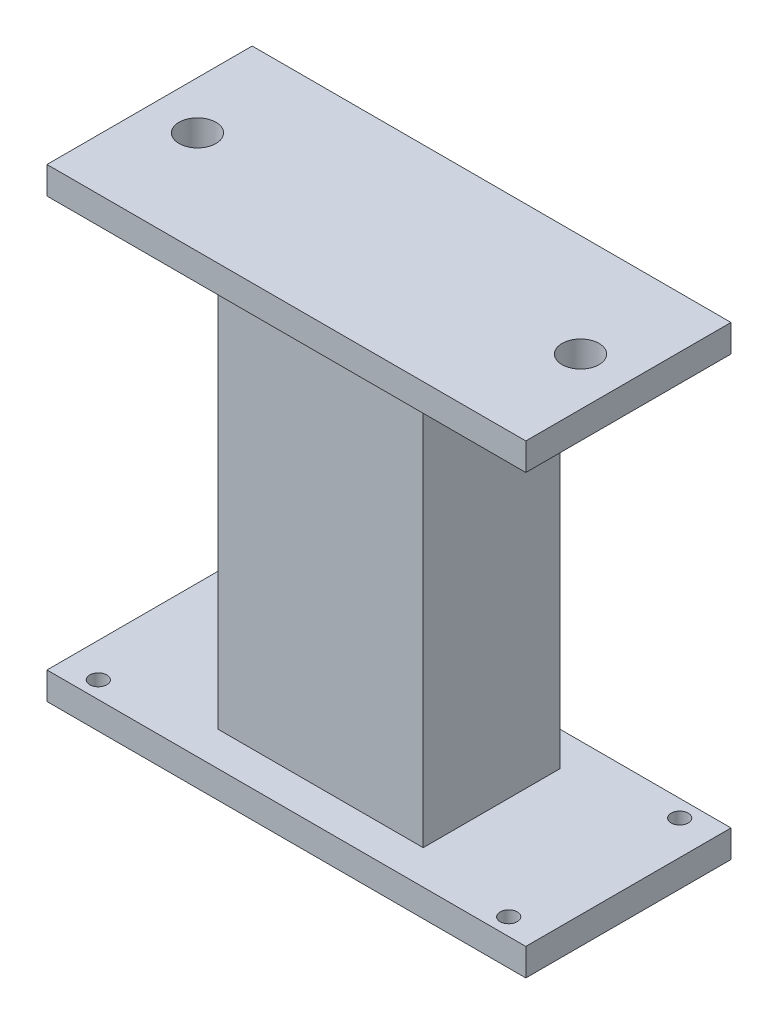
ISO-10303-21;
HEADER;
FILE_DESCRIPTION(('STEP AP214'),'2;1');
FILE_NAME('part.step','',(''),(''),'','','');
FILE_SCHEMA(('AUTOMOTIVE_DESIGN { 1 0 10303 214 1 1 1 1 }'));
ENDSEC;
DATA;
#1=APPLICATION_CONTEXT('core data for automotive mechanical design processes');
#2=APPLICATION_PROTOCOL_DEFINITION('international standard','automotive_design',2000,#1);
#3=PRODUCT_CONTEXT('',#1,'mechanical');
#4=PRODUCT('Part','Part','',(#3));
#5=PRODUCT_RELATED_PRODUCT_CATEGORY('part','',(#4));
#6=PRODUCT_DEFINITION_FORMATION('','',#4);
#7=PRODUCT_DEFINITION_CONTEXT('part definition',#1,'design');
#8=PRODUCT_DEFINITION('design','',#6,#7);
#9=PRODUCT_DEFINITION_SHAPE('','',#8);
#10=(LENGTH_UNIT() NAMED_UNIT(*) SI_UNIT(.MILLI.,.METRE.));
#11=(NAMED_UNIT(*) PLANE_ANGLE_UNIT() SI_UNIT($,.RADIAN.));
#12=(NAMED_UNIT(*) SI_UNIT($,.STERADIAN.) SOLID_ANGLE_UNIT());
#13=UNCERTAINTY_MEASURE_WITH_UNIT(LENGTH_MEASURE(1.E-05),#10,'distance_accuracy_value','');
#14=(GEOMETRIC_REPRESENTATION_CONTEXT(3) GLOBAL_UNCERTAINTY_ASSIGNED_CONTEXT((#13)) GLOBAL_UNIT_ASSIGNED_CONTEXT((#10,
#11,#12)) REPRESENTATION_CONTEXT('',''));
#15=CARTESIAN_POINT('',(0.,0.,0.));
#16=DIRECTION('',(0.,0.,1.));
#17=DIRECTION('',(1.,0.,0.));
#18=AXIS2_PLACEMENT_3D('',#15,#16,#17);
#19=CARTESIAN_POINT('',(0.,4.,0.));
#20=DIRECTION('',(0.,1.,0.));
#21=DIRECTION('',(0.,0.,1.));
#22=AXIS2_PLACEMENT_3D('',#19,#20,#21);
#23=PLANE('',#22);
#24=CARTESIAN_POINT('',(30.,4.,12.5));
#25=DIRECTION('',(0.,1.,0.));
#26=DIRECTION('',(0.,0.,-1.));
#27=AXIS2_PLACEMENT_3D('',#24,#25,#26);
#28=CIRCLE('',#27,1.25);
#29=CARTESIAN_POINT('',(30.,4.,11.25));
#30=VERTEX_POINT('',#29);
#31=EDGE_CURVE('E230',#30,#30,#28,.T.);
#32=ORIENTED_EDGE('',*,*,#31,.F.);
#33=EDGE_LOOP('',(#32));
#34=FACE_BOUND('',#33,.T.);
#35=CARTESIAN_POINT('',(-30.,4.,12.5));
#36=DIRECTION('',(0.,1.,0.));
#37=DIRECTION('',(0.,0.,1.));
#38=AXIS2_PLACEMENT_3D('',#35,#36,#37);
#39=CIRCLE('',#38,1.25);
#40=CARTESIAN_POINT('',(-30.,4.,13.75));
#41=VERTEX_POINT('',#40);
#42=EDGE_CURVE('E246',#41,#41,#39,.T.);
#43=ORIENTED_EDGE('',*,*,#42,.F.);
#44=EDGE_LOOP('',(#43));
#45=FACE_BOUND('',#44,.T.);
#46=DIRECTION('',(0.,0.,-1.));
#47=VECTOR('',#46,1.);
#48=CARTESIAN_POINT('',(35.,4.,-15.));
#49=LINE('',#48,#47);
#50=CARTESIAN_POINT('',(35.,4.,15.));
#51=VERTEX_POINT('',#50);
#52=CARTESIAN_POINT('',(35.,4.,-15.));
#53=VERTEX_POINT('',#52);
#54=EDGE_CURVE('E254',#51,#53,#49,.T.);
#55=ORIENTED_EDGE('',*,*,#54,.T.);
#56=DIRECTION('',(-1.,0.,0.));
#57=VECTOR('',#56,1.);
#58=CARTESIAN_POINT('',(-35.,4.,-15.));
#59=LINE('',#58,#57);
#60=CARTESIAN_POINT('',(-35.,4.,-15.));
#61=VERTEX_POINT('',#60);
#62=EDGE_CURVE('E98',#53,#61,#59,.T.);
#63=ORIENTED_EDGE('',*,*,#62,.T.);
#64=DIRECTION('',(0.,0.,1.));
#65=VECTOR('',#64,1.);
#66=CARTESIAN_POINT('',(-35.,4.,-15.));
#67=LINE('',#66,#65);
#68=CARTESIAN_POINT('',(-35.,4.,15.));
#69=VERTEX_POINT('',#68);
#70=EDGE_CURVE('E259',#61,#69,#67,.T.);
#71=ORIENTED_EDGE('',*,*,#70,.T.);
#72=DIRECTION('',(1.,0.,0.));
#73=VECTOR('',#72,1.);
#74=CARTESIAN_POINT('',(-35.,4.,15.));
#75=LINE('',#74,#73);
#76=EDGE_CURVE('E70',#69,#51,#75,.T.);
#77=ORIENTED_EDGE('',*,*,#76,.T.);
#78=EDGE_LOOP('',(#55,#63,#71,#77));
#79=FACE_BOUND('',#78,.T.);
#80=CARTESIAN_POINT('',(-30.,4.,-12.5));
#81=DIRECTION('',(0.,1.,0.));
#82=DIRECTION('',(0.,0.,-1.));
#83=AXIS2_PLACEMENT_3D('',#80,#81,#82);
#84=CIRCLE('',#83,1.25);
#85=CARTESIAN_POINT('',(-30.,4.,-13.75));
#86=VERTEX_POINT('',#85);
#87=EDGE_CURVE('E238',#86,#86,#84,.T.);
#88=ORIENTED_EDGE('',*,*,#87,.F.);
#89=EDGE_LOOP('',(#88));
#90=FACE_BOUND('',#89,.T.);
#91=CARTESIAN_POINT('',(30.,4.,-12.5));
#92=DIRECTION('',(0.,1.,0.));
#93=DIRECTION('',(0.,0.,1.));
#94=AXIS2_PLACEMENT_3D('',#91,#92,#93);
#95=CIRCLE('',#94,1.25);
#96=CARTESIAN_POINT('',(30.,4.,-11.25));
#97=VERTEX_POINT('',#96);
#98=EDGE_CURVE('E222',#97,#97,#95,.T.);
#99=ORIENTED_EDGE('',*,*,#98,.F.);
#100=EDGE_LOOP('',(#99));
#101=FACE_BOUND('',#100,.T.);
#102=DIRECTION('',(-1.,0.,0.));
#103=VECTOR('',#102,1.);
#104=CARTESIAN_POINT('',(-15.,4.,-10.));
#105=LINE('',#104,#103);
#106=CARTESIAN_POINT('',(15.,4.,-10.));
#107=VERTEX_POINT('',#106);
#108=CARTESIAN_POINT('',(-15.,4.,-10.));
#109=VERTEX_POINT('',#108);
#110=EDGE_CURVE('E178',#107,#109,#105,.T.);
#111=ORIENTED_EDGE('',*,*,#110,.F.);
#112=DIRECTION('',(0.,0.,-1.));
#113=VECTOR('',#112,1.);
#114=CARTESIAN_POINT('',(15.,4.,-10.));
#115=LINE('',#114,#113);
#116=CARTESIAN_POINT('',(15.,4.,10.));
#117=VERTEX_POINT('',#116);
#118=EDGE_CURVE('E173',#117,#107,#115,.T.);
#119=ORIENTED_EDGE('',*,*,#118,.F.);
#120=DIRECTION('',(1.,0.,0.));
#121=VECTOR('',#120,1.);
#122=CARTESIAN_POINT('',(-15.,4.,10.));
#123=LINE('',#122,#121);
#124=CARTESIAN_POINT('',(-15.,4.,10.));
#125=VERTEX_POINT('',#124);
#126=EDGE_CURVE('E189',#125,#117,#123,.T.);
#127=ORIENTED_EDGE('',*,*,#126,.F.);
#128=DIRECTION('',(0.,0.,1.));
#129=VECTOR('',#128,1.);
#130=CARTESIAN_POINT('',(-15.,4.,-10.));
#131=LINE('',#130,#129);
#132=EDGE_CURVE('E204',#109,#125,#131,.T.);
#133=ORIENTED_EDGE('',*,*,#132,.F.);
#134=EDGE_LOOP('',(#111,#119,#127,#133));
#135=FACE_BOUND('',#134,.T.);
#136=ADVANCED_FACE('F45',(#34,#45,#79,#90,#101,#135),#23,.T.);
#137=CARTESIAN_POINT('',(0.,0.,0.));
#138=DIRECTION('',(0.,1.,0.));
#139=DIRECTION('',(0.,0.,1.));
#140=AXIS2_PLACEMENT_3D('',#137,#138,#139);
#141=PLANE('',#140);
#142=DIRECTION('',(0.,0.,-1.));
#143=VECTOR('',#142,1.);
#144=CARTESIAN_POINT('',(35.,0.,-15.));
#145=LINE('',#144,#143);
#146=CARTESIAN_POINT('',(35.,0.,15.));
#147=VERTEX_POINT('',#146);
#148=CARTESIAN_POINT('',(35.,0.,-15.));
#149=VERTEX_POINT('',#148);
#150=EDGE_CURVE('E250',#147,#149,#145,.T.);
#151=ORIENTED_EDGE('',*,*,#150,.F.);
#152=DIRECTION('',(1.,0.,0.));
#153=VECTOR('',#152,1.);
#154=CARTESIAN_POINT('',(-35.,0.,15.));
#155=LINE('',#154,#153);
#156=CARTESIAN_POINT('',(-35.,0.,15.));
#157=VERTEX_POINT('',#156);
#158=EDGE_CURVE('E91',#157,#147,#155,.T.);
#159=ORIENTED_EDGE('',*,*,#158,.F.);
#160=DIRECTION('',(0.,0.,1.));
#161=VECTOR('',#160,1.);
#162=CARTESIAN_POINT('',(-35.,0.,-15.));
#163=LINE('',#162,#161);
#164=CARTESIAN_POINT('',(-35.,0.,-15.));
#165=VERTEX_POINT('',#164);
#166=EDGE_CURVE('E271',#165,#157,#163,.T.);
#167=ORIENTED_EDGE('',*,*,#166,.F.);
#168=DIRECTION('',(-1.,0.,0.));
#169=VECTOR('',#168,1.);
#170=CARTESIAN_POINT('',(-35.,0.,-15.));
#171=LINE('',#170,#169);
#172=EDGE_CURVE('E268',#149,#165,#171,.T.);
#173=ORIENTED_EDGE('',*,*,#172,.F.);
#174=EDGE_LOOP('',(#151,#159,#167,#173));
#175=FACE_BOUND('',#174,.T.);
#176=CARTESIAN_POINT('',(-30.,0.,12.5));
#177=DIRECTION('',(0.,1.,0.));
#178=DIRECTION('',(0.,0.,1.));
#179=AXIS2_PLACEMENT_3D('',#176,#177,#178);
#180=CIRCLE('',#179,1.25);
#181=CARTESIAN_POINT('',(-30.,0.,13.75));
#182=VERTEX_POINT('',#181);
#183=EDGE_CURVE('E242',#182,#182,#180,.T.);
#184=ORIENTED_EDGE('',*,*,#183,.T.);
#185=EDGE_LOOP('',(#184));
#186=FACE_BOUND('',#185,.T.);
#187=CARTESIAN_POINT('',(-30.,0.,-12.5));
#188=DIRECTION('',(0.,1.,0.));
#189=DIRECTION('',(0.,0.,-1.));
#190=AXIS2_PLACEMENT_3D('',#187,#188,#189);
#191=CIRCLE('',#190,1.25);
#192=CARTESIAN_POINT('',(-30.,0.,-13.75));
#193=VERTEX_POINT('',#192);
#194=EDGE_CURVE('E234',#193,#193,#191,.T.);
#195=ORIENTED_EDGE('',*,*,#194,.T.);
#196=EDGE_LOOP('',(#195));
#197=FACE_BOUND('',#196,.T.);
#198=CARTESIAN_POINT('',(30.,0.,12.5));
#199=DIRECTION('',(0.,1.,0.));
#200=DIRECTION('',(0.,0.,-1.));
#201=AXIS2_PLACEMENT_3D('',#198,#199,#200);
#202=CIRCLE('',#201,1.25);
#203=CARTESIAN_POINT('',(30.,0.,11.25));
#204=VERTEX_POINT('',#203);
#205=EDGE_CURVE('E226',#204,#204,#202,.T.);
#206=ORIENTED_EDGE('',*,*,#205,.T.);
#207=EDGE_LOOP('',(#206));
#208=FACE_BOUND('',#207,.T.);
#209=CARTESIAN_POINT('',(30.,0.,-12.5));
#210=DIRECTION('',(0.,1.,0.));
#211=DIRECTION('',(0.,0.,1.));
#212=AXIS2_PLACEMENT_3D('',#209,#210,#211);
#213=CIRCLE('',#212,1.25);
#214=CARTESIAN_POINT('',(30.,0.,-11.25));
#215=VERTEX_POINT('',#214);
#216=EDGE_CURVE('E221',#215,#215,#213,.T.);
#217=ORIENTED_EDGE('',*,*,#216,.T.);
#218=EDGE_LOOP('',(#217));
#219=FACE_BOUND('',#218,.T.);
#220=ADVANCED_FACE('F289',(#175,#186,#197,#208,#219),#141,.F.);
#221=CARTESIAN_POINT('',(35.,4.,-15.));
#222=DIRECTION('',(-1.,0.,0.));
#223=DIRECTION('',(0.,0.,1.));
#224=AXIS2_PLACEMENT_3D('',#221,#222,#223);
#225=PLANE('',#224);
#226=ORIENTED_EDGE('',*,*,#150,.T.);
#227=DIRECTION('',(0.,-1.,0.));
#228=VECTOR('',#227,1.);
#229=CARTESIAN_POINT('',(35.,4.,-15.));
#230=LINE('',#229,#228);
#231=EDGE_CURVE('E11',#53,#149,#230,.T.);
#232=ORIENTED_EDGE('',*,*,#231,.F.);
#233=ORIENTED_EDGE('',*,*,#54,.F.);
#234=DIRECTION('',(0.,-1.,0.));
#235=VECTOR('',#234,1.);
#236=CARTESIAN_POINT('',(35.,4.,15.));
#237=LINE('',#236,#235);
#238=EDGE_CURVE('E264',#51,#147,#237,.T.);
#239=ORIENTED_EDGE('',*,*,#238,.T.);
#240=EDGE_LOOP('',(#226,#232,#233,#239));
#241=FACE_BOUND('',#240,.T.);
#242=ADVANCED_FACE('F47',(#241),#225,.F.);
#243=CARTESIAN_POINT('',(-35.,4.,-15.));
#244=DIRECTION('',(0.,0.,1.));
#245=DIRECTION('',(1.,0.,0.));
#246=AXIS2_PLACEMENT_3D('',#243,#244,#245);
#247=PLANE('',#246);
#248=ORIENTED_EDGE('',*,*,#172,.T.);
#249=DIRECTION('',(0.,-1.,0.));
#250=VECTOR('',#249,1.);
#251=CARTESIAN_POINT('',(-35.,4.,-15.));
#252=LINE('',#251,#250);
#253=EDGE_CURVE('E54',#61,#165,#252,.T.);
#254=ORIENTED_EDGE('',*,*,#253,.F.);
#255=ORIENTED_EDGE('',*,*,#62,.F.);
#256=ORIENTED_EDGE('',*,*,#231,.T.);
#257=EDGE_LOOP('',(#248,#254,#255,#256));
#258=FACE_BOUND('',#257,.T.);
#259=ADVANCED_FACE('F305',(#258),#247,.F.);
#260=CARTESIAN_POINT('',(-35.,4.,-15.));
#261=DIRECTION('',(1.,0.,0.));
#262=DIRECTION('',(0.,0.,-1.));
#263=AXIS2_PLACEMENT_3D('',#260,#261,#262);
#264=PLANE('',#263);
#265=ORIENTED_EDGE('',*,*,#166,.T.);
#266=DIRECTION('',(0.,-1.,0.));
#267=VECTOR('',#266,1.);
#268=CARTESIAN_POINT('',(-35.,4.,15.));
#269=LINE('',#268,#267);
#270=EDGE_CURVE('E278',#69,#157,#269,.T.);
#271=ORIENTED_EDGE('',*,*,#270,.F.);
#272=ORIENTED_EDGE('',*,*,#70,.F.);
#273=ORIENTED_EDGE('',*,*,#253,.T.);
#274=EDGE_LOOP('',(#265,#271,#272,#273));
#275=FACE_BOUND('',#274,.T.);
#276=ADVANCED_FACE('F285',(#275),#264,.F.);
#277=CARTESIAN_POINT('',(-35.,4.,15.));
#278=DIRECTION('',(0.,0.,-1.));
#279=DIRECTION('',(-1.,0.,0.));
#280=AXIS2_PLACEMENT_3D('',#277,#278,#279);
#281=PLANE('',#280);
#282=ORIENTED_EDGE('',*,*,#158,.T.);
#283=ORIENTED_EDGE('',*,*,#238,.F.);
#284=ORIENTED_EDGE('',*,*,#76,.F.);
#285=ORIENTED_EDGE('',*,*,#270,.T.);
#286=EDGE_LOOP('',(#282,#283,#284,#285));
#287=FACE_BOUND('',#286,.T.);
#288=ADVANCED_FACE('F294',(#287),#281,.F.);
#289=CARTESIAN_POINT('',(-30.,4.,12.5));
#290=DIRECTION('',(0.,-1.,0.));
#291=DIRECTION('',(0.,0.,-1.));
#292=AXIS2_PLACEMENT_3D('',#289,#290,#291);
#293=CYLINDRICAL_SURFACE('',#292,1.25);
#294=ORIENTED_EDGE('',*,*,#42,.T.);
#295=EDGE_LOOP('',(#294));
#296=FACE_BOUND('',#295,.T.);
#297=ORIENTED_EDGE('',*,*,#183,.F.);
#298=EDGE_LOOP('',(#297));
#299=FACE_BOUND('',#298,.T.);
#300=ADVANCED_FACE('F296',(#296,#299),#293,.F.);
#301=CARTESIAN_POINT('',(-30.,4.,-12.5));
#302=DIRECTION('',(0.,-1.,0.));
#303=DIRECTION('',(0.,0.,-1.));
#304=AXIS2_PLACEMENT_3D('',#301,#302,#303);
#305=CYLINDRICAL_SURFACE('',#304,1.25);
#306=ORIENTED_EDGE('',*,*,#87,.T.);
#307=EDGE_LOOP('',(#306));
#308=FACE_BOUND('',#307,.T.);
#309=ORIENTED_EDGE('',*,*,#194,.F.);
#310=EDGE_LOOP('',(#309));
#311=FACE_BOUND('',#310,.T.);
#312=ADVANCED_FACE('F302',(#308,#311),#305,.F.);
#313=CARTESIAN_POINT('',(30.,4.,12.5));
#314=DIRECTION('',(0.,-1.,0.));
#315=DIRECTION('',(0.,0.,-1.));
#316=AXIS2_PLACEMENT_3D('',#313,#314,#315);
#317=CYLINDRICAL_SURFACE('',#316,1.25);
#318=ORIENTED_EDGE('',*,*,#31,.T.);
#319=EDGE_LOOP('',(#318));
#320=FACE_BOUND('',#319,.T.);
#321=ORIENTED_EDGE('',*,*,#205,.F.);
#322=EDGE_LOOP('',(#321));
#323=FACE_BOUND('',#322,.T.);
#324=ADVANCED_FACE('F321',(#320,#323),#317,.F.);
#325=CARTESIAN_POINT('',(30.,4.,-12.5));
#326=DIRECTION('',(0.,-1.,0.));
#327=DIRECTION('',(0.,0.,-1.));
#328=AXIS2_PLACEMENT_3D('',#325,#326,#327);
#329=CYLINDRICAL_SURFACE('',#328,1.25);
#330=ORIENTED_EDGE('',*,*,#98,.T.);
#331=EDGE_LOOP('',(#330));
#332=FACE_BOUND('',#331,.T.);
#333=ORIENTED_EDGE('',*,*,#216,.F.);
#334=EDGE_LOOP('',(#333));
#335=FACE_BOUND('',#334,.T.);
#336=ADVANCED_FACE('F325',(#332,#335),#329,.F.);
#337=CARTESIAN_POINT('',(15.,64.0001011,-10.));
#338=DIRECTION('',(-1.,0.,0.));
#339=DIRECTION('',(0.,0.,1.));
#340=AXIS2_PLACEMENT_3D('',#337,#338,#339);
#341=PLANE('',#340);
#342=ORIENTED_EDGE('',*,*,#118,.T.);
#343=DIRECTION('',(0.,-1.,0.));
#344=VECTOR('',#343,1.);
#345=CARTESIAN_POINT('',(15.,64.0001011,-10.));
#346=LINE('',#345,#344);
#347=CARTESIAN_POINT('',(15.,64.0001011,-10.));
#348=VERTEX_POINT('',#347);
#349=EDGE_CURVE('E218',#348,#107,#346,.T.);
#350=ORIENTED_EDGE('',*,*,#349,.F.);
#351=DIRECTION('',(0.,0.,-1.));
#352=VECTOR('',#351,1.);
#353=CARTESIAN_POINT('',(15.,64.0001011,-10.));
#354=LINE('',#353,#352);
#355=CARTESIAN_POINT('',(15.,64.0001011,10.));
#356=VERTEX_POINT('',#355);
#357=EDGE_CURVE('E184',#356,#348,#354,.T.);
#358=ORIENTED_EDGE('',*,*,#357,.F.);
#359=DIRECTION('',(0.,-1.,0.));
#360=VECTOR('',#359,1.);
#361=CARTESIAN_POINT('',(15.,64.0001011,10.));
#362=LINE('',#361,#360);
#363=EDGE_CURVE('E200',#356,#117,#362,.T.);
#364=ORIENTED_EDGE('',*,*,#363,.T.);
#365=EDGE_LOOP('',(#342,#350,#358,#364));
#366=FACE_BOUND('',#365,.T.);
#367=ADVANCED_FACE('F328',(#366),#341,.F.);
#368=CARTESIAN_POINT('',(-15.,64.0001011,-10.));
#369=DIRECTION('',(0.,0.,1.));
#370=DIRECTION('',(1.,0.,0.));
#371=AXIS2_PLACEMENT_3D('',#368,#369,#370);
#372=PLANE('',#371);
#373=ORIENTED_EDGE('',*,*,#110,.T.);
#374=DIRECTION('',(0.,-1.,0.));
#375=VECTOR('',#374,1.);
#376=CARTESIAN_POINT('',(-15.,64.0001011,-10.));
#377=LINE('',#376,#375);
#378=CARTESIAN_POINT('',(-15.,64.0001011,-10.));
#379=VERTEX_POINT('',#378);
#380=EDGE_CURVE('E214',#379,#109,#377,.T.);
#381=ORIENTED_EDGE('',*,*,#380,.F.);
#382=DIRECTION('',(-1.,0.,0.));
#383=VECTOR('',#382,1.);
#384=CARTESIAN_POINT('',(-15.,64.0001011,-10.));
#385=LINE('',#384,#383);
#386=EDGE_CURVE('E188',#348,#379,#385,.T.);
#387=ORIENTED_EDGE('',*,*,#386,.F.);
#388=ORIENTED_EDGE('',*,*,#349,.T.);
#389=EDGE_LOOP('',(#373,#381,#387,#388));
#390=FACE_BOUND('',#389,.T.);
#391=ADVANCED_FACE('F331',(#390),#372,.F.);
#392=CARTESIAN_POINT('',(-15.,64.0001011,-10.));
#393=DIRECTION('',(1.,0.,0.));
#394=DIRECTION('',(0.,0.,-1.));
#395=AXIS2_PLACEMENT_3D('',#392,#393,#394);
#396=PLANE('',#395);
#397=ORIENTED_EDGE('',*,*,#132,.T.);
#398=DIRECTION('',(0.,-1.,0.));
#399=VECTOR('',#398,1.);
#400=CARTESIAN_POINT('',(-15.,64.0001011,10.));
#401=LINE('',#400,#399);
#402=CARTESIAN_POINT('',(-15.,64.0001011,10.));
#403=VERTEX_POINT('',#402);
#404=EDGE_CURVE('E61',#403,#125,#401,.T.);
#405=ORIENTED_EDGE('',*,*,#404,.F.);
#406=DIRECTION('',(0.,0.,1.));
#407=VECTOR('',#406,1.);
#408=CARTESIAN_POINT('',(-15.,64.0001011,-10.));
#409=LINE('',#408,#407);
#410=EDGE_CURVE('E193',#379,#403,#409,.T.);
#411=ORIENTED_EDGE('',*,*,#410,.F.);
#412=ORIENTED_EDGE('',*,*,#380,.T.);
#413=EDGE_LOOP('',(#397,#405,#411,#412));
#414=FACE_BOUND('',#413,.T.);
#415=ADVANCED_FACE('F335',(#414),#396,.F.);
#416=CARTESIAN_POINT('',(-15.,64.0001011,10.));
#417=DIRECTION('',(0.,0.,-1.));
#418=DIRECTION('',(-1.,0.,0.));
#419=AXIS2_PLACEMENT_3D('',#416,#417,#418);
#420=PLANE('',#419);
#421=ORIENTED_EDGE('',*,*,#126,.T.);
#422=ORIENTED_EDGE('',*,*,#363,.F.);
#423=DIRECTION('',(1.,0.,0.));
#424=VECTOR('',#423,1.);
#425=CARTESIAN_POINT('',(-15.,64.0001011,10.));
#426=LINE('',#425,#424);
#427=EDGE_CURVE('E197',#403,#356,#426,.T.);
#428=ORIENTED_EDGE('',*,*,#427,.F.);
#429=ORIENTED_EDGE('',*,*,#404,.T.);
#430=EDGE_LOOP('',(#421,#422,#428,#429));
#431=FACE_BOUND('',#430,.T.);
#432=ADVANCED_FACE('F339',(#431),#420,.F.);
#433=CARTESIAN_POINT('',(0.,64.0001011,0.));
#434=DIRECTION('',(0.,1.,0.));
#435=DIRECTION('',(0.,0.,1.));
#436=AXIS2_PLACEMENT_3D('',#433,#434,#435);
#437=PLANE('',#436);
#438=DIRECTION('',(0.,0.,-1.));
#439=VECTOR('',#438,1.);
#440=CARTESIAN_POINT('',(35.,64.0001011,-15.));
#441=LINE('',#440,#439);
#442=CARTESIAN_POINT('',(35.,64.0001011,15.));
#443=VERTEX_POINT('',#442);
#444=CARTESIAN_POINT('',(35.,64.0001011,-15.));
#445=VERTEX_POINT('',#444);
#446=EDGE_CURVE('E171',#443,#445,#441,.T.);
#447=ORIENTED_EDGE('',*,*,#446,.F.);
#448=DIRECTION('',(1.,0.,0.));
#449=VECTOR('',#448,1.);
#450=CARTESIAN_POINT('',(-35.,64.0001011,15.));
#451=LINE('',#450,#449);
#452=CARTESIAN_POINT('',(-35.,64.0001011,15.));
#453=VERTEX_POINT('',#452);
#454=EDGE_CURVE('E167',#453,#443,#451,.T.);
#455=ORIENTED_EDGE('',*,*,#454,.F.);
#456=DIRECTION('',(0.,0.,1.));
#457=VECTOR('',#456,1.);
#458=CARTESIAN_POINT('',(-35.,64.0001011,-15.));
#459=LINE('',#458,#457);
#460=CARTESIAN_POINT('',(-35.,64.0001011,-15.));
#461=VERTEX_POINT('',#460);
#462=EDGE_CURVE('E402',#461,#453,#459,.T.);
#463=ORIENTED_EDGE('',*,*,#462,.F.);
#464=DIRECTION('',(-1.,0.,0.));
#465=VECTOR('',#464,1.);
#466=CARTESIAN_POINT('',(-35.,64.0001011,-15.));
#467=LINE('',#466,#465);
#468=EDGE_CURVE('E399',#445,#461,#467,.T.);
#469=ORIENTED_EDGE('',*,*,#468,.F.);
#470=EDGE_LOOP('',(#447,#455,#463,#469));
#471=FACE_BOUND('',#470,.T.);
#472=CARTESIAN_POINT('',(-28.,64.0001011,0.));
#473=DIRECTION('',(0.,1.,0.));
#474=DIRECTION('',(0.,0.,1.));
#475=AXIS2_PLACEMENT_3D('',#472,#473,#474);
#476=CIRCLE('',#475,2.7);
#477=CARTESIAN_POINT('',(-28.,64.0001011,2.7));
#478=VERTEX_POINT('',#477);
#479=EDGE_CURVE('E382',#478,#478,#476,.T.);
#480=ORIENTED_EDGE('',*,*,#479,.T.);
#481=EDGE_LOOP('',(#480));
#482=FACE_BOUND('',#481,.T.);
#483=CARTESIAN_POINT('',(28.,64.0001011,0.));
#484=DIRECTION('',(0.,1.,0.));
#485=DIRECTION('',(0.,0.,-1.));
#486=AXIS2_PLACEMENT_3D('',#483,#484,#485);
#487=CIRCLE('',#486,2.7);
#488=CARTESIAN_POINT('',(28.,64.0001011,-2.7));
#489=VERTEX_POINT('',#488);
#490=EDGE_CURVE('E377',#489,#489,#487,.T.);
#491=ORIENTED_EDGE('',*,*,#490,.T.);
#492=EDGE_LOOP('',(#491));
#493=FACE_BOUND('',#492,.T.);
#494=ORIENTED_EDGE('',*,*,#427,.T.);
#495=ORIENTED_EDGE('',*,*,#357,.T.);
#496=ORIENTED_EDGE('',*,*,#386,.T.);
#497=ORIENTED_EDGE('',*,*,#410,.T.);
#498=EDGE_LOOP('',(#494,#495,#496,#497));
#499=FACE_BOUND('',#498,.T.);
#500=ADVANCED_FACE('F343',(#471,#482,#493,#499),#437,.F.);
#501=CARTESIAN_POINT('',(0.,68.0001011,0.));
#502=DIRECTION('',(0.,1.,0.));
#503=DIRECTION('',(0.,0.,1.));
#504=AXIS2_PLACEMENT_3D('',#501,#502,#503);
#505=PLANE('',#504);
#506=CARTESIAN_POINT('',(-28.,68.0001011,0.));
#507=DIRECTION('',(0.,1.,0.));
#508=DIRECTION('',(0.,0.,1.));
#509=AXIS2_PLACEMENT_3D('',#506,#507,#508);
#510=CIRCLE('',#509,2.7);
#511=CARTESIAN_POINT('',(-28.,68.0001011,2.7));
#512=VERTEX_POINT('',#511);
#513=EDGE_CURVE('E385',#512,#512,#510,.T.);
#514=ORIENTED_EDGE('',*,*,#513,.F.);
#515=EDGE_LOOP('',(#514));
#516=FACE_BOUND('',#515,.T.);
#517=DIRECTION('',(0.,0.,-1.));
#518=VECTOR('',#517,1.);
#519=CARTESIAN_POINT('',(35.,68.0001011,-15.));
#520=LINE('',#519,#518);
#521=CARTESIAN_POINT('',(35.,68.0001011,15.));
#522=VERTEX_POINT('',#521);
#523=CARTESIAN_POINT('',(35.,68.0001011,-15.));
#524=VERTEX_POINT('',#523);
#525=EDGE_CURVE('E156',#522,#524,#520,.T.);
#526=ORIENTED_EDGE('',*,*,#525,.T.);
#527=DIRECTION('',(-1.,0.,0.));
#528=VECTOR('',#527,1.);
#529=CARTESIAN_POINT('',(-35.,68.0001011,-15.));
#530=LINE('',#529,#528);
#531=CARTESIAN_POINT('',(-35.,68.0001011,-15.));
#532=VERTEX_POINT('',#531);
#533=EDGE_CURVE('E144',#524,#532,#530,.T.);
#534=ORIENTED_EDGE('',*,*,#533,.T.);
#535=DIRECTION('',(0.,0.,1.));
#536=VECTOR('',#535,1.);
#537=CARTESIAN_POINT('',(-35.,68.0001011,-15.));
#538=LINE('',#537,#536);
#539=CARTESIAN_POINT('',(-35.,68.0001011,15.));
#540=VERTEX_POINT('',#539);
#541=EDGE_CURVE('E155',#532,#540,#538,.T.);
#542=ORIENTED_EDGE('',*,*,#541,.T.);
#543=DIRECTION('',(1.,0.,0.));
#544=VECTOR('',#543,1.);
#545=CARTESIAN_POINT('',(-35.,68.0001011,15.));
#546=LINE('',#545,#544);
#547=EDGE_CURVE('E162',#540,#522,#546,.T.);
#548=ORIENTED_EDGE('',*,*,#547,.T.);
#549=EDGE_LOOP('',(#526,#534,#542,#548));
#550=FACE_BOUND('',#549,.T.);
#551=CARTESIAN_POINT('',(28.,68.0001011,0.));
#552=DIRECTION('',(0.,1.,0.));
#553=DIRECTION('',(0.,0.,-1.));
#554=AXIS2_PLACEMENT_3D('',#551,#552,#553);
#555=CIRCLE('',#554,2.7);
#556=CARTESIAN_POINT('',(28.,68.0001011,-2.7));
#557=VERTEX_POINT('',#556);
#558=EDGE_CURVE('E374',#557,#557,#555,.T.);
#559=ORIENTED_EDGE('',*,*,#558,.F.);
#560=EDGE_LOOP('',(#559));
#561=FACE_BOUND('',#560,.T.);
#562=ADVANCED_FACE('F159',(#516,#550,#561),#505,.T.);
#563=CARTESIAN_POINT('',(35.,68.0001011,-15.));
#564=DIRECTION('',(-1.,0.,0.));
#565=DIRECTION('',(0.,0.,1.));
#566=AXIS2_PLACEMENT_3D('',#563,#564,#565);
#567=PLANE('',#566);
#568=ORIENTED_EDGE('',*,*,#446,.T.);
#569=DIRECTION('',(0.,-1.,0.));
#570=VECTOR('',#569,1.);
#571=CARTESIAN_POINT('',(35.,68.0001011,-15.));
#572=LINE('',#571,#570);
#573=EDGE_CURVE('E148',#524,#445,#572,.T.);
#574=ORIENTED_EDGE('',*,*,#573,.F.);
#575=ORIENTED_EDGE('',*,*,#525,.F.);
#576=DIRECTION('',(0.,-1.,0.));
#577=VECTOR('',#576,1.);
#578=CARTESIAN_POINT('',(35.,68.0001011,15.));
#579=LINE('',#578,#577);
#580=EDGE_CURVE('E396',#522,#443,#579,.T.);
#581=ORIENTED_EDGE('',*,*,#580,.T.);
#582=EDGE_LOOP('',(#568,#574,#575,#581));
#583=FACE_BOUND('',#582,.T.);
#584=ADVANCED_FACE('F169',(#583),#567,.F.);
#585=CARTESIAN_POINT('',(-35.,68.0001011,-15.));
#586=DIRECTION('',(0.,0.,1.));
#587=DIRECTION('',(1.,0.,0.));
#588=AXIS2_PLACEMENT_3D('',#585,#586,#587);
#589=PLANE('',#588);
#590=ORIENTED_EDGE('',*,*,#468,.T.);
#591=DIRECTION('',(0.,-1.,0.));
#592=VECTOR('',#591,1.);
#593=CARTESIAN_POINT('',(-35.,68.0001011,-15.));
#594=LINE('',#593,#592);
#595=EDGE_CURVE('E151',#532,#461,#594,.T.);
#596=ORIENTED_EDGE('',*,*,#595,.F.);
#597=ORIENTED_EDGE('',*,*,#533,.F.);
#598=ORIENTED_EDGE('',*,*,#573,.T.);
#599=EDGE_LOOP('',(#590,#596,#597,#598));
#600=FACE_BOUND('',#599,.T.);
#601=ADVANCED_FACE('F146',(#600),#589,.F.);
#602=CARTESIAN_POINT('',(-35.,68.0001011,-15.));
#603=DIRECTION('',(1.,0.,0.));
#604=DIRECTION('',(0.,0.,-1.));
#605=AXIS2_PLACEMENT_3D('',#602,#603,#604);
#606=PLANE('',#605);
#607=ORIENTED_EDGE('',*,*,#462,.T.);
#608=DIRECTION('',(0.,-1.,0.));
#609=VECTOR('',#608,1.);
#610=CARTESIAN_POINT('',(-35.,68.0001011,15.));
#611=LINE('',#610,#609);
#612=EDGE_CURVE('E180',#540,#453,#611,.T.);
#613=ORIENTED_EDGE('',*,*,#612,.F.);
#614=ORIENTED_EDGE('',*,*,#541,.F.);
#615=ORIENTED_EDGE('',*,*,#595,.T.);
#616=EDGE_LOOP('',(#607,#613,#614,#615));
#617=FACE_BOUND('',#616,.T.);
#618=ADVANCED_FACE('F348',(#617),#606,.F.);
#619=CARTESIAN_POINT('',(-35.,68.0001011,15.));
#620=DIRECTION('',(0.,0.,-1.));
#621=DIRECTION('',(-1.,0.,0.));
#622=AXIS2_PLACEMENT_3D('',#619,#620,#621);
#623=PLANE('',#622);
#624=ORIENTED_EDGE('',*,*,#454,.T.);
#625=ORIENTED_EDGE('',*,*,#580,.F.);
#626=ORIENTED_EDGE('',*,*,#547,.F.);
#627=ORIENTED_EDGE('',*,*,#612,.T.);
#628=EDGE_LOOP('',(#624,#625,#626,#627));
#629=FACE_BOUND('',#628,.T.);
#630=ADVANCED_FACE('F351',(#629),#623,.F.);
#631=CARTESIAN_POINT('',(-28.,68.0001011,0.));
#632=DIRECTION('',(0.,-1.,0.));
#633=DIRECTION('',(0.,0.,-1.));
#634=AXIS2_PLACEMENT_3D('',#631,#632,#633);
#635=CYLINDRICAL_SURFACE('',#634,2.7);
#636=ORIENTED_EDGE('',*,*,#513,.T.);
#637=EDGE_LOOP('',(#636));
#638=FACE_BOUND('',#637,.T.);
#639=ORIENTED_EDGE('',*,*,#479,.F.);
#640=EDGE_LOOP('',(#639));
#641=FACE_BOUND('',#640,.T.);
#642=ADVANCED_FACE('F355',(#638,#641),#635,.F.);
#643=CARTESIAN_POINT('',(28.,68.0001011,0.));
#644=DIRECTION('',(0.,-1.,0.));
#645=DIRECTION('',(0.,0.,-1.));
#646=AXIS2_PLACEMENT_3D('',#643,#644,#645);
#647=CYLINDRICAL_SURFACE('',#646,2.7);
#648=ORIENTED_EDGE('',*,*,#558,.T.);
#649=EDGE_LOOP('',(#648));
#650=FACE_BOUND('',#649,.T.);
#651=ORIENTED_EDGE('',*,*,#490,.F.);
#652=EDGE_LOOP('',(#651));
#653=FACE_BOUND('',#652,.T.);
#654=ADVANCED_FACE('F365',(#650,#653),#647,.F.);
#655=CLOSED_SHELL('',(#136,#220,#242,#259,#276,#288,#300,#312,#324,#336,#367,#391,#415,#432,
#500,#562,#584,#601,#618,#630,#642,#654));
#656=MANIFOLD_SOLID_BREP('B2',#655);
#657=ADVANCED_BREP_SHAPE_REPRESENTATION('',(#18,#656),#14);
#658=SHAPE_DEFINITION_REPRESENTATION(#9,#657);
ENDSEC;
END-ISO-10303-21;
